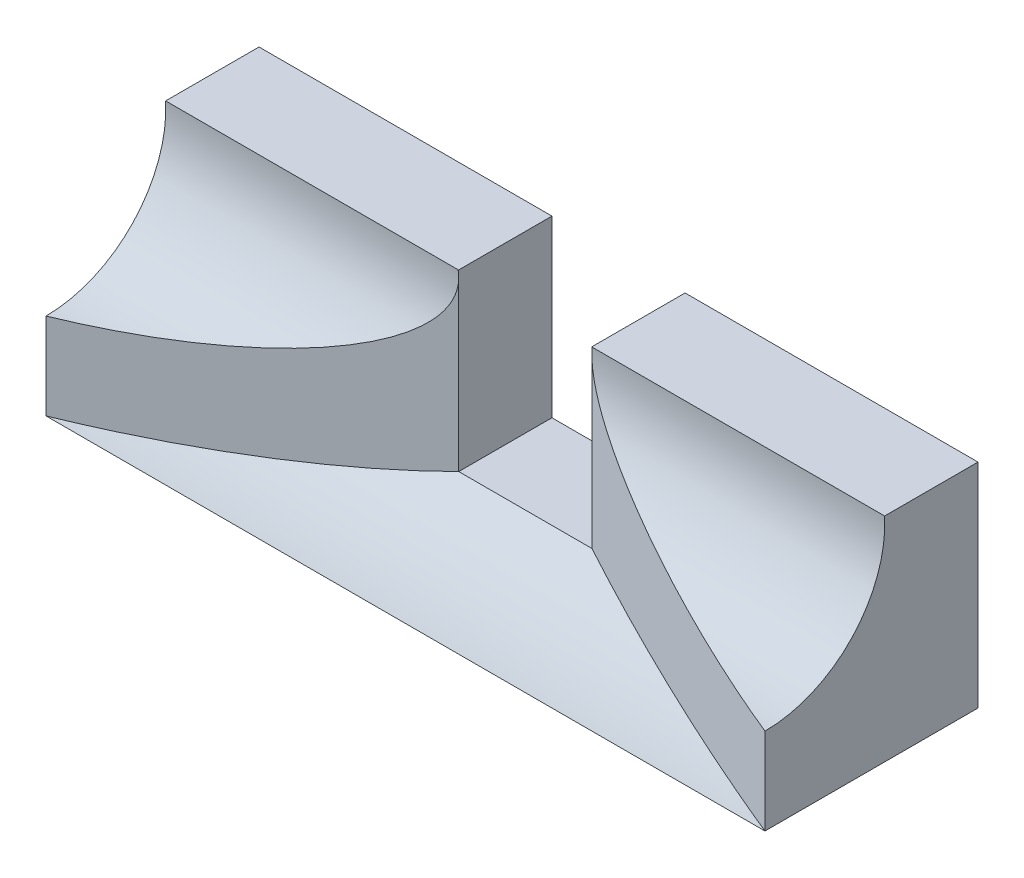
ISO-10303-21;
HEADER;
FILE_DESCRIPTION(('STEP AP214'),'2;1');
FILE_NAME('part.step','',(''),(''),'','','');
FILE_SCHEMA(('AUTOMOTIVE_DESIGN { 1 0 10303 214 1 1 1 1 }'));
ENDSEC;
DATA;
#1=APPLICATION_CONTEXT('core data for automotive mechanical design processes');
#2=APPLICATION_PROTOCOL_DEFINITION('international standard','automotive_design',2000,#1);
#3=PRODUCT_CONTEXT('',#1,'mechanical');
#4=PRODUCT('Part','Part','',(#3));
#5=PRODUCT_RELATED_PRODUCT_CATEGORY('part','',(#4));
#6=PRODUCT_DEFINITION_FORMATION('','',#4);
#7=PRODUCT_DEFINITION_CONTEXT('part definition',#1,'design');
#8=PRODUCT_DEFINITION('design','',#6,#7);
#9=PRODUCT_DEFINITION_SHAPE('','',#8);
#10=(LENGTH_UNIT() NAMED_UNIT(*) SI_UNIT(.MILLI.,.METRE.));
#11=(NAMED_UNIT(*) PLANE_ANGLE_UNIT() SI_UNIT($,.RADIAN.));
#12=(NAMED_UNIT(*) SI_UNIT($,.STERADIAN.) SOLID_ANGLE_UNIT());
#13=UNCERTAINTY_MEASURE_WITH_UNIT(LENGTH_MEASURE(1.E-05),#10,'distance_accuracy_value','');
#14=(GEOMETRIC_REPRESENTATION_CONTEXT(3) GLOBAL_UNCERTAINTY_ASSIGNED_CONTEXT((#13)) GLOBAL_UNIT_ASSIGNED_CONTEXT((#10,
#11,#12)) REPRESENTATION_CONTEXT('',''));
#15=CARTESIAN_POINT('',(0.,0.,0.));
#16=DIRECTION('',(0.,0.,1.));
#17=DIRECTION('',(1.,0.,0.));
#18=AXIS2_PLACEMENT_3D('',#15,#16,#17);
#19=CARTESIAN_POINT('',(0.,80.,0.));
#20=DIRECTION('',(0.,1.,0.));
#21=DIRECTION('',(0.,0.,1.));
#22=AXIS2_PLACEMENT_3D('',#19,#20,#21);
#23=PLANE('',#22);
#24=DIRECTION('',(0.,0.,1.));
#25=VECTOR('',#24,1.);
#26=CARTESIAN_POINT('',(-25.,80.,-40.));
#27=LINE('',#26,#25);
#28=CARTESIAN_POINT('',(-25.,80.,-40.));
#29=VERTEX_POINT('',#28);
#30=CARTESIAN_POINT('',(-25.,80.,-5.00000000000002));
#31=VERTEX_POINT('',#30);
#32=EDGE_CURVE('E137',#29,#31,#27,.T.);
#33=ORIENTED_EDGE('',*,*,#32,.F.);
#34=DIRECTION('',(-1.,0.,0.));
#35=VECTOR('',#34,1.);
#36=CARTESIAN_POINT('',(-135.,80.,-40.));
#37=LINE('',#36,#35);
#38=CARTESIAN_POINT('',(-135.,80.,-40.));
#39=VERTEX_POINT('',#38);
#40=EDGE_CURVE('E57',#29,#39,#37,.T.);
#41=ORIENTED_EDGE('',*,*,#40,.T.);
#42=DIRECTION('',(0.,0.,1.));
#43=VECTOR('',#42,1.);
#44=CARTESIAN_POINT('',(-135.,80.,-40.));
#45=LINE('',#44,#43);
#46=CARTESIAN_POINT('',(-135.,80.,-4.93050188902879));
#47=VERTEX_POINT('',#46);
#48=EDGE_CURVE('E91',#39,#47,#45,.T.);
#49=ORIENTED_EDGE('',*,*,#48,.T.);
#50=DIRECTION('',(1.,0.,0.));
#51=VECTOR('',#50,1.);
#52=CARTESIAN_POINT('',(-135.,80.,-4.93050188902879));
#53=LINE('',#52,#51);
#54=CARTESIAN_POINT('',(-25.1698842712631,80.,-4.93050188902875));
#55=VERTEX_POINT('',#54);
#56=EDGE_CURVE('E153',#55,#47,#53,.F.);
#57=ORIENTED_EDGE('',*,*,#56,.F.);
#58=DIRECTION('',(-0.925546956205677,0.,0.378632845720504));
#59=VECTOR('',#58,1.);
#60=CARTESIAN_POINT('',(-5.33628318584071,80.,-13.0442477876106));
#61=LINE('',#60,#59);
#62=EDGE_CURVE('E162',#31,#55,#61,.T.);
#63=ORIENTED_EDGE('',*,*,#62,.F.);
#64=EDGE_LOOP('',(#33,#41,#49,#57,#63));
#65=FACE_BOUND('',#64,.T.);
#66=ADVANCED_FACE('F33',(#65),#23,.T.);
#67=CARTESIAN_POINT('',(-5.33628318584071,0.,-13.0442477876106));
#68=DIRECTION('',(-0.378632845720504,0.,-0.925546956205677));
#69=DIRECTION('',(-0.925546956205677,0.,0.378632845720504));
#70=AXIS2_PLACEMENT_3D('',#67,#68,#69);
#71=PLANE('',#70);
#72=DIRECTION('',(0.,1.,0.));
#73=VECTOR('',#72,1.);
#74=CARTESIAN_POINT('',(-25.,0.,-5.00000000000002));
#75=LINE('',#74,#73);
#76=CARTESIAN_POINT('',(-25.,14.40285267938,-5.00000000000002));
#77=VERTEX_POINT('',#76);
#78=CARTESIAN_POINT('',(-25.,77.5,-5.00000000000002));
#79=VERTEX_POINT('',#78);
#80=EDGE_CURVE('E144',#77,#79,#75,.T.);
#81=ORIENTED_EDGE('',*,*,#80,.T.);
#82=CARTESIAN_POINT('',(-135.,77.5,39.9999999999998));
#83=DIRECTION('',(-0.378632845720504,0.,-0.925546956205677));
#84=DIRECTION('',(0.925546956205677,0.,-0.378632845720504));
#85=AXIS2_PLACEMENT_3D('',#82,#83,#84);
#86=ELLIPSE('',#85,118.848643240047,45.);
#87=CARTESIAN_POINT('',(-135.,32.5,40.));
#88=VERTEX_POINT('',#87);
#89=EDGE_CURVE('E149',#79,#88,#86,.T.);
#90=ORIENTED_EDGE('',*,*,#89,.T.);
#91=DIRECTION('',(0.,-1.,0.));
#92=VECTOR('',#91,1.);
#93=CARTESIAN_POINT('',(-135.,80.,40.));
#94=LINE('',#93,#92);
#95=CARTESIAN_POINT('',(-135.,0.,40.));
#96=VERTEX_POINT('',#95);
#97=EDGE_CURVE('E92',#88,#96,#94,.T.);
#98=ORIENTED_EDGE('',*,*,#97,.T.);
#99=CARTESIAN_POINT('',(-135.,77.5,39.9999999999998));
#100=DIRECTION('',(-0.378632845720504,0.,-0.925546956205677));
#101=DIRECTION('',(0.925546956205677,0.,-0.378632845720504));
#102=AXIS2_PLACEMENT_3D('',#99,#100,#101);
#103=ELLIPSE('',#102,204.68377446897,77.5);
#104=EDGE_CURVE('E147',#96,#77,#103,.F.);
#105=ORIENTED_EDGE('',*,*,#104,.T.);
#106=EDGE_LOOP('',(#81,#90,#98,#105));
#107=FACE_BOUND('',#106,.T.);
#108=ADVANCED_FACE('F187',(#107),#71,.F.);
#109=CARTESIAN_POINT('',(5.33628318584072,0.,-13.0442477876106));
#110=DIRECTION('',(-0.378632845720504,0.,0.925546956205677));
#111=DIRECTION('',(0.925546956205677,0.,0.378632845720504));
#112=AXIS2_PLACEMENT_3D('',#109,#110,#111);
#113=PLANE('',#112);
#114=CARTESIAN_POINT('',(135.,77.5,39.9999999999999));
#115=DIRECTION('',(-0.378632845720504,0.,0.925546956205677));
#116=DIRECTION('',(0.925546956205677,0.,0.378632845720504));
#117=AXIS2_PLACEMENT_3D('',#114,#115,#116);
#118=ELLIPSE('',#117,118.848643240047,45.);
#119=CARTESIAN_POINT('',(25.1698842712632,80.,-4.93050188902874));
#120=VERTEX_POINT('',#119);
#121=CARTESIAN_POINT('',(25.,77.5,-5.00000000000002));
#122=VERTEX_POINT('',#121);
#123=EDGE_CURVE('E11',#120,#122,#118,.T.);
#124=ORIENTED_EDGE('',*,*,#123,.F.);
#125=DIRECTION('',(0.925546956205677,0.,0.378632845720504));
#126=VECTOR('',#125,1.);
#127=CARTESIAN_POINT('',(5.33628318584072,80.,-13.0442477876106));
#128=LINE('',#127,#126);
#129=CARTESIAN_POINT('',(25.,80.,-5.00000000000002));
#130=VERTEX_POINT('',#129);
#131=EDGE_CURVE('E159',#130,#120,#128,.T.);
#132=ORIENTED_EDGE('',*,*,#131,.F.);
#133=DIRECTION('',(0.,1.,0.));
#134=VECTOR('',#133,1.);
#135=CARTESIAN_POINT('',(25.,0.,-5.00000000000002));
#136=LINE('',#135,#134);
#137=EDGE_CURVE('E165',#122,#130,#136,.T.);
#138=ORIENTED_EDGE('',*,*,#137,.F.);
#139=EDGE_LOOP('',(#124,#132,#138));
#140=FACE_BOUND('',#139,.T.);
#141=ADVANCED_FACE('F244',(#140),#113,.T.);
#142=CARTESIAN_POINT('',(135.,80.,-40.));
#143=DIRECTION('',(-1.,0.,0.));
#144=DIRECTION('',(0.,0.,1.));
#145=AXIS2_PLACEMENT_3D('',#142,#143,#144);
#146=PLANE('',#145);
#147=DIRECTION('',(0.,0.,-1.));
#148=VECTOR('',#147,1.);
#149=CARTESIAN_POINT('',(135.,80.,-40.));
#150=LINE('',#149,#148);
#151=CARTESIAN_POINT('',(135.,80.,-4.93050188902869));
#152=VERTEX_POINT('',#151);
#153=CARTESIAN_POINT('',(135.,80.,-40.));
#154=VERTEX_POINT('',#153);
#155=EDGE_CURVE('E98',#152,#154,#150,.T.);
#156=ORIENTED_EDGE('',*,*,#155,.F.);
#157=CARTESIAN_POINT('',(135.,77.5,39.9999999999999));
#158=DIRECTION('',(1.,0.,0.));
#159=DIRECTION('',(0.,0.,-1.));
#160=AXIS2_PLACEMENT_3D('',#157,#158,#159);
#161=CIRCLE('',#160,45.);
#162=CARTESIAN_POINT('',(135.,32.5,40.));
#163=VERTEX_POINT('',#162);
#164=EDGE_CURVE('E123',#163,#152,#161,.T.);
#165=ORIENTED_EDGE('',*,*,#164,.F.);
#166=DIRECTION('',(0.,-1.,0.));
#167=VECTOR('',#166,1.);
#168=CARTESIAN_POINT('',(135.,80.,40.));
#169=LINE('',#168,#167);
#170=CARTESIAN_POINT('',(135.,0.,40.));
#171=VERTEX_POINT('',#170);
#172=EDGE_CURVE('E103',#163,#171,#169,.T.);
#173=ORIENTED_EDGE('',*,*,#172,.T.);
#174=DIRECTION('',(0.,0.,-1.));
#175=VECTOR('',#174,1.);
#176=CARTESIAN_POINT('',(135.,0.,-40.));
#177=LINE('',#176,#175);
#178=CARTESIAN_POINT('',(135.,0.,-40.));
#179=VERTEX_POINT('',#178);
#180=EDGE_CURVE('E83',#171,#179,#177,.T.);
#181=ORIENTED_EDGE('',*,*,#180,.T.);
#182=DIRECTION('',(0.,-1.,0.));
#183=VECTOR('',#182,1.);
#184=CARTESIAN_POINT('',(135.,80.,-40.));
#185=LINE('',#184,#183);
#186=EDGE_CURVE('E77',#154,#179,#185,.T.);
#187=ORIENTED_EDGE('',*,*,#186,.F.);
#188=EDGE_LOOP('',(#156,#165,#173,#181,#187));
#189=FACE_BOUND('',#188,.T.);
#190=ADVANCED_FACE('F35',(#189),#146,.F.);
#191=CARTESIAN_POINT('',(-135.,80.,-40.));
#192=DIRECTION('',(0.,0.,1.));
#193=DIRECTION('',(1.,0.,0.));
#194=AXIS2_PLACEMENT_3D('',#191,#192,#193);
#195=PLANE('',#194);
#196=ORIENTED_EDGE('',*,*,#40,.F.);
#197=DIRECTION('',(0.,-1.,0.));
#198=VECTOR('',#197,1.);
#199=CARTESIAN_POINT('',(-25.,14.4028526793801,-40.));
#200=LINE('',#199,#198);
#201=CARTESIAN_POINT('',(-25.,14.4028526793801,-40.));
#202=VERTEX_POINT('',#201);
#203=EDGE_CURVE('E207',#29,#202,#200,.T.);
#204=ORIENTED_EDGE('',*,*,#203,.T.);
#205=DIRECTION('',(1.,0.,0.));
#206=VECTOR('',#205,1.);
#207=CARTESIAN_POINT('',(-25.,14.4028526793801,-40.));
#208=LINE('',#207,#206);
#209=CARTESIAN_POINT('',(25.,14.4028526793801,-40.));
#210=VERTEX_POINT('',#209);
#211=EDGE_CURVE('E204',#202,#210,#208,.T.);
#212=ORIENTED_EDGE('',*,*,#211,.T.);
#213=DIRECTION('',(0.,1.,0.));
#214=VECTOR('',#213,1.);
#215=CARTESIAN_POINT('',(25.,14.4028526793801,-40.));
#216=LINE('',#215,#214);
#217=CARTESIAN_POINT('',(25.,80.,-40.));
#218=VERTEX_POINT('',#217);
#219=EDGE_CURVE('E194',#210,#218,#216,.T.);
#220=ORIENTED_EDGE('',*,*,#219,.T.);
#221=EDGE_CURVE('E170',#154,#218,#37,.T.);
#222=ORIENTED_EDGE('',*,*,#221,.F.);
#223=ORIENTED_EDGE('',*,*,#186,.T.);
#224=DIRECTION('',(-1.,0.,0.));
#225=VECTOR('',#224,1.);
#226=CARTESIAN_POINT('',(-135.,0.,-40.));
#227=LINE('',#226,#225);
#228=CARTESIAN_POINT('',(-135.,0.,-40.));
#229=VERTEX_POINT('',#228);
#230=EDGE_CURVE('E70',#179,#229,#227,.T.);
#231=ORIENTED_EDGE('',*,*,#230,.T.);
#232=DIRECTION('',(0.,-1.,0.));
#233=VECTOR('',#232,1.);
#234=CARTESIAN_POINT('',(-135.,80.,-40.));
#235=LINE('',#234,#233);
#236=EDGE_CURVE('E73',#39,#229,#235,.T.);
#237=ORIENTED_EDGE('',*,*,#236,.F.);
#238=EDGE_LOOP('',(#196,#204,#212,#220,#222,#223,#231,#237));
#239=FACE_BOUND('',#238,.T.);
#240=ADVANCED_FACE('F72',(#239),#195,.F.);
#241=CARTESIAN_POINT('',(-135.,80.,-40.));
#242=DIRECTION('',(1.,0.,0.));
#243=DIRECTION('',(0.,0.,-1.));
#244=AXIS2_PLACEMENT_3D('',#241,#242,#243);
#245=PLANE('',#244);
#246=ORIENTED_EDGE('',*,*,#97,.F.);
#247=CARTESIAN_POINT('',(-135.,77.5,39.9999999999998));
#248=DIRECTION('',(1.,0.,0.));
#249=DIRECTION('',(0.,0.,-1.));
#250=AXIS2_PLACEMENT_3D('',#247,#248,#249);
#251=CIRCLE('',#250,45.);
#252=EDGE_CURVE('E136',#88,#47,#251,.T.);
#253=ORIENTED_EDGE('',*,*,#252,.T.);
#254=ORIENTED_EDGE('',*,*,#48,.F.);
#255=ORIENTED_EDGE('',*,*,#236,.T.);
#256=DIRECTION('',(0.,0.,1.));
#257=VECTOR('',#256,1.);
#258=CARTESIAN_POINT('',(-135.,0.,-40.));
#259=LINE('',#258,#257);
#260=EDGE_CURVE('E82',#229,#96,#259,.T.);
#261=ORIENTED_EDGE('',*,*,#260,.T.);
#262=EDGE_LOOP('',(#246,#253,#254,#255,#261));
#263=FACE_BOUND('',#262,.T.);
#264=ADVANCED_FACE('F88',(#263),#245,.F.);
#265=DIRECTION('',(0.,0.,1.));
#266=VECTOR('',#265,1.);
#267=CARTESIAN_POINT('',(25.,80.,-40.));
#268=LINE('',#267,#266);
#269=EDGE_CURVE('E197',#218,#130,#268,.T.);
#270=ORIENTED_EDGE('',*,*,#269,.T.);
#271=ORIENTED_EDGE('',*,*,#131,.T.);
#272=EDGE_CURVE('E189',#152,#120,#53,.F.);
#273=ORIENTED_EDGE('',*,*,#272,.F.);
#274=ORIENTED_EDGE('',*,*,#155,.T.);
#275=ORIENTED_EDGE('',*,*,#221,.T.);
#276=EDGE_LOOP('',(#270,#271,#273,#274,#275));
#277=FACE_BOUND('',#276,.T.);
#278=ADVANCED_FACE('F240',(#277),#23,.T.);
#279=CARTESIAN_POINT('',(0.,0.,0.));
#280=DIRECTION('',(0.,1.,0.));
#281=DIRECTION('',(0.,0.,1.));
#282=AXIS2_PLACEMENT_3D('',#279,#280,#281);
#283=PLANE('',#282);
#284=DIRECTION('',(1.,0.,0.));
#285=VECTOR('',#284,1.);
#286=CARTESIAN_POINT('',(-248.137084989848,0.,39.9999999999998));
#287=LINE('',#286,#285);
#288=EDGE_CURVE('E97',#96,#171,#287,.T.);
#289=ORIENTED_EDGE('',*,*,#288,.F.);
#290=ORIENTED_EDGE('',*,*,#260,.F.);
#291=ORIENTED_EDGE('',*,*,#230,.F.);
#292=ORIENTED_EDGE('',*,*,#180,.F.);
#293=EDGE_LOOP('',(#289,#290,#291,#292));
#294=FACE_BOUND('',#293,.T.);
#295=ADVANCED_FACE('F95',(#294),#283,.F.);
#296=ORIENTED_EDGE('',*,*,#62,.T.);
#297=EDGE_CURVE('E155',#55,#79,#86,.T.);
#298=ORIENTED_EDGE('',*,*,#297,.T.);
#299=EDGE_CURVE('E168',#79,#31,#75,.T.);
#300=ORIENTED_EDGE('',*,*,#299,.T.);
#301=EDGE_LOOP('',(#296,#298,#300));
#302=FACE_BOUND('',#301,.T.);
#303=ADVANCED_FACE('F226',(#302),#71,.F.);
#304=EDGE_CURVE('E37',#122,#163,#118,.T.);
#305=ORIENTED_EDGE('',*,*,#304,.F.);
#306=CARTESIAN_POINT('',(25.,14.4028526793801,-5.00000000000002));
#307=VERTEX_POINT('',#306);
#308=EDGE_CURVE('E141',#307,#122,#136,.T.);
#309=ORIENTED_EDGE('',*,*,#308,.F.);
#310=CARTESIAN_POINT('',(135.,77.5,39.9999999999999));
#311=DIRECTION('',(-0.378632845720504,0.,0.925546956205677));
#312=DIRECTION('',(0.925546956205677,0.,0.378632845720504));
#313=AXIS2_PLACEMENT_3D('',#310,#311,#312);
#314=ELLIPSE('',#313,204.68377446897,77.5);
#315=EDGE_CURVE('E108',#171,#307,#314,.F.);
#316=ORIENTED_EDGE('',*,*,#315,.F.);
#317=ORIENTED_EDGE('',*,*,#172,.F.);
#318=EDGE_LOOP('',(#305,#309,#316,#317));
#319=FACE_BOUND('',#318,.T.);
#320=ADVANCED_FACE('F139',(#319),#113,.T.);
#321=CARTESIAN_POINT('',(-248.137084989848,77.5,39.9999999999998));
#322=DIRECTION('',(1.,0.,0.));
#323=DIRECTION('',(0.,0.,-1.));
#324=AXIS2_PLACEMENT_3D('',#321,#322,#323);
#325=CYLINDRICAL_SURFACE('',#324,77.5);
#326=ORIENTED_EDGE('',*,*,#104,.F.);
#327=ORIENTED_EDGE('',*,*,#288,.T.);
#328=ORIENTED_EDGE('',*,*,#315,.T.);
#329=DIRECTION('',(1.,0.,0.));
#330=VECTOR('',#329,1.);
#331=CARTESIAN_POINT('',(-248.137084989848,14.40285267938,-4.99999999999999));
#332=LINE('',#331,#330);
#333=EDGE_CURVE('E148',#77,#307,#332,.T.);
#334=ORIENTED_EDGE('',*,*,#333,.F.);
#335=EDGE_LOOP('',(#326,#327,#328,#334));
#336=FACE_BOUND('',#335,.T.);
#337=ADVANCED_FACE('F145',(#336),#325,.F.);
#338=CARTESIAN_POINT('',(-135.,77.5,39.9999999999998));
#339=DIRECTION('',(1.,0.,0.));
#340=DIRECTION('',(0.,0.,-1.));
#341=AXIS2_PLACEMENT_3D('',#338,#339,#340);
#342=CYLINDRICAL_SURFACE('',#341,45.);
#343=ORIENTED_EDGE('',*,*,#272,.T.);
#344=ORIENTED_EDGE('',*,*,#123,.T.);
#345=ORIENTED_EDGE('',*,*,#304,.T.);
#346=ORIENTED_EDGE('',*,*,#164,.T.);
#347=EDGE_LOOP('',(#343,#344,#345,#346));
#348=FACE_BOUND('',#347,.T.);
#349=ADVANCED_FACE('F121',(#348),#342,.F.);
#350=ORIENTED_EDGE('',*,*,#297,.F.);
#351=ORIENTED_EDGE('',*,*,#56,.T.);
#352=ORIENTED_EDGE('',*,*,#252,.F.);
#353=ORIENTED_EDGE('',*,*,#89,.F.);
#354=EDGE_LOOP('',(#350,#351,#352,#353));
#355=FACE_BOUND('',#354,.T.);
#356=ADVANCED_FACE('F228',(#355),#342,.F.);
#357=CARTESIAN_POINT('',(-25.,14.4028526793801,-40.));
#358=DIRECTION('',(-1.,0.,0.));
#359=DIRECTION('',(0.,0.,1.));
#360=AXIS2_PLACEMENT_3D('',#357,#358,#359);
#361=PLANE('',#360);
#362=ORIENTED_EDGE('',*,*,#299,.F.);
#363=ORIENTED_EDGE('',*,*,#80,.F.);
#364=DIRECTION('',(0.,0.,1.));
#365=VECTOR('',#364,1.);
#366=CARTESIAN_POINT('',(-25.,14.4028526793801,-40.));
#367=LINE('',#366,#365);
#368=EDGE_CURVE('E48',#202,#77,#367,.T.);
#369=ORIENTED_EDGE('',*,*,#368,.F.);
#370=ORIENTED_EDGE('',*,*,#203,.F.);
#371=ORIENTED_EDGE('',*,*,#32,.T.);
#372=EDGE_LOOP('',(#362,#363,#369,#370,#371));
#373=FACE_BOUND('',#372,.T.);
#374=ADVANCED_FACE('F217',(#373),#361,.F.);
#375=CARTESIAN_POINT('',(25.,14.4028526793801,-40.));
#376=DIRECTION('',(1.,0.,0.));
#377=DIRECTION('',(0.,0.,-1.));
#378=AXIS2_PLACEMENT_3D('',#375,#376,#377);
#379=PLANE('',#378);
#380=ORIENTED_EDGE('',*,*,#308,.T.);
#381=ORIENTED_EDGE('',*,*,#137,.T.);
#382=ORIENTED_EDGE('',*,*,#269,.F.);
#383=ORIENTED_EDGE('',*,*,#219,.F.);
#384=DIRECTION('',(0.,0.,1.));
#385=VECTOR('',#384,1.);
#386=CARTESIAN_POINT('',(25.,14.4028526793801,-40.));
#387=LINE('',#386,#385);
#388=EDGE_CURVE('E193',#210,#307,#387,.T.);
#389=ORIENTED_EDGE('',*,*,#388,.T.);
#390=EDGE_LOOP('',(#380,#381,#382,#383,#389));
#391=FACE_BOUND('',#390,.T.);
#392=ADVANCED_FACE('F235',(#391),#379,.F.);
#393=CARTESIAN_POINT('',(-25.,14.4028526793801,-40.));
#394=DIRECTION('',(0.,-1.,0.));
#395=DIRECTION('',(0.,0.,-1.));
#396=AXIS2_PLACEMENT_3D('',#393,#394,#395);
#397=PLANE('',#396);
#398=ORIENTED_EDGE('',*,*,#333,.T.);
#399=ORIENTED_EDGE('',*,*,#388,.F.);
#400=ORIENTED_EDGE('',*,*,#211,.F.);
#401=ORIENTED_EDGE('',*,*,#368,.T.);
#402=EDGE_LOOP('',(#398,#399,#400,#401));
#403=FACE_BOUND('',#402,.T.);
#404=ADVANCED_FACE('F265',(#403),#397,.F.);
#405=CLOSED_SHELL('',(#66,#108,#141,#190,#240,#264,#278,#295,#303,#320,#337,#349,#356,#374,#392,#404));
#406=MANIFOLD_SOLID_BREP('B2',#405);
#407=ADVANCED_BREP_SHAPE_REPRESENTATION('',(#18,#406),#14);
#408=SHAPE_DEFINITION_REPRESENTATION(#9,#407);
ENDSEC;
END-ISO-10303-21;
